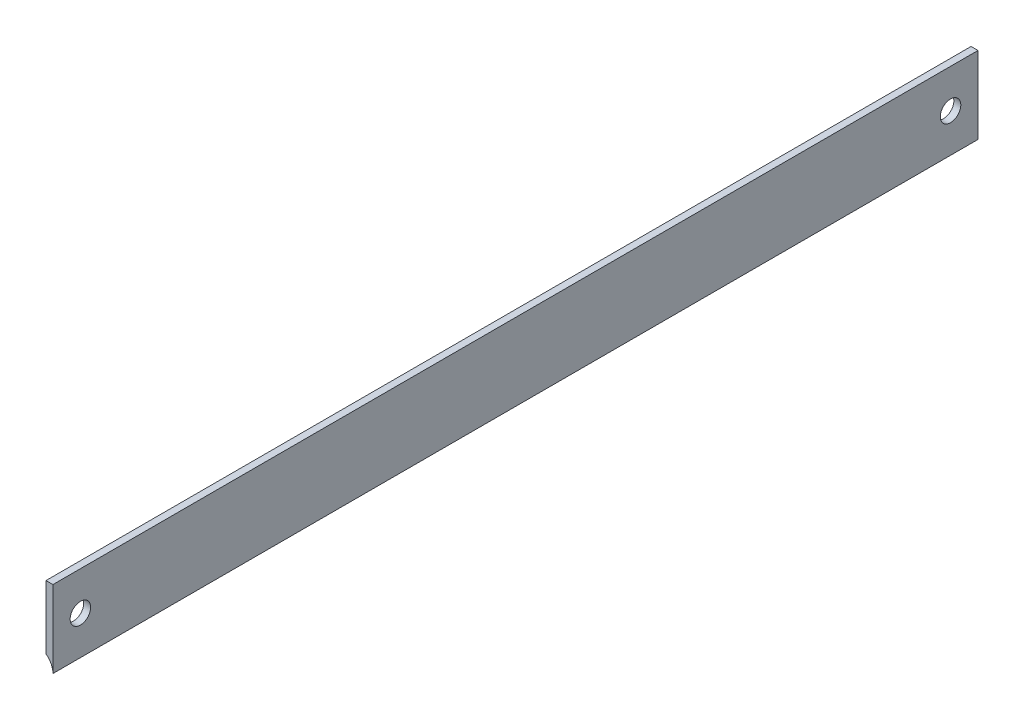
ISO-10303-21;
HEADER;
FILE_DESCRIPTION(('STEP AP214'),'2;1');
FILE_NAME('part.step','',(''),(''),'','','');
FILE_SCHEMA(('AUTOMOTIVE_DESIGN { 1 0 10303 214 1 1 1 1 }'));
ENDSEC;
DATA;
#1=APPLICATION_CONTEXT('core data for automotive mechanical design processes');
#2=APPLICATION_PROTOCOL_DEFINITION('international standard','automotive_design',2000,#1);
#3=PRODUCT_CONTEXT('',#1,'mechanical');
#4=PRODUCT('Part','Part','',(#3));
#5=PRODUCT_RELATED_PRODUCT_CATEGORY('part','',(#4));
#6=PRODUCT_DEFINITION_FORMATION('','',#4);
#7=PRODUCT_DEFINITION_CONTEXT('part definition',#1,'design');
#8=PRODUCT_DEFINITION('design','',#6,#7);
#9=PRODUCT_DEFINITION_SHAPE('','',#8);
#10=(LENGTH_UNIT() NAMED_UNIT(*) SI_UNIT(.MILLI.,.METRE.));
#11=(NAMED_UNIT(*) PLANE_ANGLE_UNIT() SI_UNIT($,.RADIAN.));
#12=(NAMED_UNIT(*) SI_UNIT($,.STERADIAN.) SOLID_ANGLE_UNIT());
#13=UNCERTAINTY_MEASURE_WITH_UNIT(LENGTH_MEASURE(1.E-05),#10,'distance_accuracy_value','');
#14=(GEOMETRIC_REPRESENTATION_CONTEXT(3) GLOBAL_UNCERTAINTY_ASSIGNED_CONTEXT((#13)) GLOBAL_UNIT_ASSIGNED_CONTEXT((#10,
#11,#12)) REPRESENTATION_CONTEXT('',''));
#15=CARTESIAN_POINT('',(0.,0.,0.));
#16=DIRECTION('',(0.,0.,1.));
#17=DIRECTION('',(1.,0.,0.));
#18=AXIS2_PLACEMENT_3D('',#15,#16,#17);
#19=CARTESIAN_POINT('',(1.143,-12.7,304.8));
#20=DIRECTION('',(-1.,0.,0.));
#21=DIRECTION('',(0.,0.,1.));
#22=AXIS2_PLACEMENT_3D('',#19,#20,#21);
#23=PLANE('',#22);
#24=CARTESIAN_POINT('',(1.143,0.,9.050000188));
#25=DIRECTION('',(-1.,0.,0.));
#26=DIRECTION('',(0.,0.,1.));
#27=AXIS2_PLACEMENT_3D('',#24,#25,#26);
#28=CIRCLE('',#27,3.37819999999999);
#29=CARTESIAN_POINT('',(1.143,0.,12.428200188));
#30=VERTEX_POINT('',#29);
#31=EDGE_CURVE('E114',#30,#30,#28,.T.);
#32=ORIENTED_EDGE('',*,*,#31,.T.);
#33=EDGE_LOOP('',(#32));
#34=FACE_BOUND('',#33,.T.);
#35=CARTESIAN_POINT('',(1.143,0.,295.749999812));
#36=DIRECTION('',(-1.,0.,0.));
#37=DIRECTION('',(0.,0.,1.));
#38=AXIS2_PLACEMENT_3D('',#35,#36,#37);
#39=CIRCLE('',#38,3.37819999999999);
#40=CARTESIAN_POINT('',(1.143,0.,299.128199812));
#41=VERTEX_POINT('',#40);
#42=EDGE_CURVE('E98',#41,#41,#39,.T.);
#43=ORIENTED_EDGE('',*,*,#42,.T.);
#44=EDGE_LOOP('',(#43));
#45=FACE_BOUND('',#44,.T.);
#46=DIRECTION('',(0.,1.,0.));
#47=VECTOR('',#46,1.);
#48=CARTESIAN_POINT('',(1.143,-12.7,0.));
#49=LINE('',#48,#47);
#50=CARTESIAN_POINT('',(1.143,-12.7,0.));
#51=VERTEX_POINT('',#50);
#52=CARTESIAN_POINT('',(1.143,12.7,0.));
#53=VERTEX_POINT('',#52);
#54=EDGE_CURVE('E95',#51,#53,#49,.T.);
#55=ORIENTED_EDGE('',*,*,#54,.T.);
#56=DIRECTION('',(0.,0.,-1.));
#57=VECTOR('',#56,1.);
#58=CARTESIAN_POINT('',(1.143,12.7,304.8));
#59=LINE('',#58,#57);
#60=CARTESIAN_POINT('',(1.143,12.7,304.8));
#61=VERTEX_POINT('',#60);
#62=EDGE_CURVE('E11',#61,#53,#59,.T.);
#63=ORIENTED_EDGE('',*,*,#62,.F.);
#64=DIRECTION('',(0.,1.,0.));
#65=VECTOR('',#64,1.);
#66=CARTESIAN_POINT('',(1.143,-12.7,304.8));
#67=LINE('',#66,#65);
#68=CARTESIAN_POINT('',(1.143,-12.7,304.8));
#69=VERTEX_POINT('',#68);
#70=EDGE_CURVE('E83',#69,#61,#67,.T.);
#71=ORIENTED_EDGE('',*,*,#70,.F.);
#72=DIRECTION('',(0.,0.,-1.));
#73=VECTOR('',#72,1.);
#74=CARTESIAN_POINT('',(1.143,-12.7,304.8));
#75=LINE('',#74,#73);
#76=EDGE_CURVE('E91',#69,#51,#75,.T.);
#77=ORIENTED_EDGE('',*,*,#76,.T.);
#78=EDGE_LOOP('',(#55,#63,#71,#77));
#79=FACE_BOUND('',#78,.T.);
#80=ADVANCED_FACE('F32',(#34,#45,#79),#23,.F.);
#81=CARTESIAN_POINT('',(-1.143,12.7,304.8));
#82=DIRECTION('',(0.,-1.,0.));
#83=DIRECTION('',(0.,0.,-1.));
#84=AXIS2_PLACEMENT_3D('',#81,#82,#83);
#85=PLANE('',#84);
#86=DIRECTION('',(-1.,0.,0.));
#87=VECTOR('',#86,1.);
#88=CARTESIAN_POINT('',(-1.143,12.7,0.));
#89=LINE('',#88,#87);
#90=CARTESIAN_POINT('',(-1.143,12.7,0.));
#91=VERTEX_POINT('',#90);
#92=EDGE_CURVE('E87',#53,#91,#89,.T.);
#93=ORIENTED_EDGE('',*,*,#92,.T.);
#94=DIRECTION('',(0.,0.,-1.));
#95=VECTOR('',#94,1.);
#96=CARTESIAN_POINT('',(-1.143,12.7,304.8));
#97=LINE('',#96,#95);
#98=CARTESIAN_POINT('',(-1.143,12.7,304.8));
#99=VERTEX_POINT('',#98);
#100=EDGE_CURVE('E40',#99,#91,#97,.T.);
#101=ORIENTED_EDGE('',*,*,#100,.F.);
#102=DIRECTION('',(-1.,0.,0.));
#103=VECTOR('',#102,1.);
#104=CARTESIAN_POINT('',(-1.143,12.7,304.8));
#105=LINE('',#104,#103);
#106=EDGE_CURVE('E78',#61,#99,#105,.T.);
#107=ORIENTED_EDGE('',*,*,#106,.F.);
#108=ORIENTED_EDGE('',*,*,#62,.T.);
#109=EDGE_LOOP('',(#93,#101,#107,#108));
#110=FACE_BOUND('',#109,.T.);
#111=ADVANCED_FACE('F86',(#110),#85,.F.);
#112=CARTESIAN_POINT('',(-1.143,-8.25681465612788,304.8));
#113=DIRECTION('',(1.,0.,0.));
#114=DIRECTION('',(0.,1.,0.));
#115=AXIS2_PLACEMENT_3D('',#112,#113,#114);
#116=PLANE('',#115);
#117=CARTESIAN_POINT('',(-1.143,0.,9.050000188));
#118=DIRECTION('',(-1.,0.,0.));
#119=DIRECTION('',(0.,0.,1.));
#120=AXIS2_PLACEMENT_3D('',#117,#118,#119);
#121=CIRCLE('',#120,3.37819999999999);
#122=CARTESIAN_POINT('',(-1.143,0.,12.428200188));
#123=VERTEX_POINT('',#122);
#124=EDGE_CURVE('E117',#123,#123,#121,.T.);
#125=ORIENTED_EDGE('',*,*,#124,.F.);
#126=EDGE_LOOP('',(#125));
#127=FACE_BOUND('',#126,.T.);
#128=CARTESIAN_POINT('',(-1.143,0.,295.749999812));
#129=DIRECTION('',(-1.,0.,0.));
#130=DIRECTION('',(0.,0.,1.));
#131=AXIS2_PLACEMENT_3D('',#128,#129,#130);
#132=CIRCLE('',#131,3.37819999999999);
#133=CARTESIAN_POINT('',(-1.143,0.,299.128199812));
#134=VERTEX_POINT('',#133);
#135=EDGE_CURVE('E111',#134,#134,#132,.T.);
#136=ORIENTED_EDGE('',*,*,#135,.F.);
#137=EDGE_LOOP('',(#136));
#138=FACE_BOUND('',#137,.T.);
#139=DIRECTION('',(0.,-1.,0.));
#140=VECTOR('',#139,1.);
#141=CARTESIAN_POINT('',(-1.143,-8.25681465612788,0.));
#142=LINE('',#141,#140);
#143=CARTESIAN_POINT('',(-1.143,-8.25681465612788,0.));
#144=VERTEX_POINT('',#143);
#145=EDGE_CURVE('E65',#91,#144,#142,.T.);
#146=ORIENTED_EDGE('',*,*,#145,.T.);
#147=DIRECTION('',(0.,0.,-1.));
#148=VECTOR('',#147,1.);
#149=CARTESIAN_POINT('',(-1.143,-8.25681465612788,304.8));
#150=LINE('',#149,#148);
#151=CARTESIAN_POINT('',(-1.143,-8.25681465612788,304.8));
#152=VERTEX_POINT('',#151);
#153=EDGE_CURVE('E88',#152,#144,#150,.T.);
#154=ORIENTED_EDGE('',*,*,#153,.F.);
#155=DIRECTION('',(0.,-1.,0.));
#156=VECTOR('',#155,1.);
#157=CARTESIAN_POINT('',(-1.143,-8.25681465612788,304.8));
#158=LINE('',#157,#156);
#159=EDGE_CURVE('E81',#99,#152,#158,.T.);
#160=ORIENTED_EDGE('',*,*,#159,.F.);
#161=ORIENTED_EDGE('',*,*,#100,.T.);
#162=EDGE_LOOP('',(#146,#154,#160,#161));
#163=FACE_BOUND('',#162,.T.);
#164=ADVANCED_FACE('F89',(#127,#138,#163),#116,.F.);
#165=CARTESIAN_POINT('',(-4.318,-12.7,304.8));
#166=DIRECTION('',(0.,0.,-1.));
#167=DIRECTION('',(-1.,0.,0.));
#168=AXIS2_PLACEMENT_3D('',#165,#166,#167);
#169=CYLINDRICAL_SURFACE('',#168,5.461);
#170=CARTESIAN_POINT('',(-4.318,-12.7,0.));
#171=DIRECTION('',(0.,0.,-1.));
#172=DIRECTION('',(1.,0.,0.));
#173=AXIS2_PLACEMENT_3D('',#170,#171,#172);
#174=CIRCLE('',#173,5.461);
#175=EDGE_CURVE('E71',#144,#51,#174,.T.);
#176=ORIENTED_EDGE('',*,*,#175,.T.);
#177=ORIENTED_EDGE('',*,*,#76,.F.);
#178=CARTESIAN_POINT('',(-4.318,-12.7,304.8));
#179=DIRECTION('',(0.,0.,-1.));
#180=DIRECTION('',(1.,0.,0.));
#181=AXIS2_PLACEMENT_3D('',#178,#179,#180);
#182=CIRCLE('',#181,5.461);
#183=EDGE_CURVE('E48',#152,#69,#182,.T.);
#184=ORIENTED_EDGE('',*,*,#183,.F.);
#185=ORIENTED_EDGE('',*,*,#153,.T.);
#186=EDGE_LOOP('',(#176,#177,#184,#185));
#187=FACE_BOUND('',#186,.T.);
#188=ADVANCED_FACE('F103',(#187),#169,.F.);
#189=CARTESIAN_POINT('',(-4.318,-12.7,304.8));
#190=DIRECTION('',(0.,0.,1.));
#191=DIRECTION('',(1.,0.,0.));
#192=AXIS2_PLACEMENT_3D('',#189,#190,#191);
#193=PLANE('',#192);
#194=ORIENTED_EDGE('',*,*,#70,.T.);
#195=ORIENTED_EDGE('',*,*,#106,.T.);
#196=ORIENTED_EDGE('',*,*,#159,.T.);
#197=ORIENTED_EDGE('',*,*,#183,.T.);
#198=EDGE_LOOP('',(#194,#195,#196,#197));
#199=FACE_BOUND('',#198,.T.);
#200=ADVANCED_FACE('F79',(#199),#193,.T.);
#201=CARTESIAN_POINT('',(-4.318,-12.7,0.));
#202=DIRECTION('',(0.,0.,1.));
#203=DIRECTION('',(1.,0.,0.));
#204=AXIS2_PLACEMENT_3D('',#201,#202,#203);
#205=PLANE('',#204);
#206=ORIENTED_EDGE('',*,*,#54,.F.);
#207=ORIENTED_EDGE('',*,*,#175,.F.);
#208=ORIENTED_EDGE('',*,*,#145,.F.);
#209=ORIENTED_EDGE('',*,*,#92,.F.);
#210=EDGE_LOOP('',(#206,#207,#208,#209));
#211=FACE_BOUND('',#210,.T.);
#212=ADVANCED_FACE('F106',(#211),#205,.F.);
#213=CARTESIAN_POINT('',(-1.143,0.,295.749999812));
#214=DIRECTION('',(-1.,0.,0.));
#215=DIRECTION('',(0.,0.,1.));
#216=AXIS2_PLACEMENT_3D('',#213,#214,#215);
#217=CYLINDRICAL_SURFACE('',#216,3.37819999999999);
#218=ORIENTED_EDGE('',*,*,#42,.F.);
#219=EDGE_LOOP('',(#218));
#220=FACE_BOUND('',#219,.T.);
#221=ORIENTED_EDGE('',*,*,#135,.T.);
#222=EDGE_LOOP('',(#221));
#223=FACE_BOUND('',#222,.T.);
#224=ADVANCED_FACE('F128',(#220,#223),#217,.F.);
#225=CARTESIAN_POINT('',(-1.143,0.,9.050000188));
#226=DIRECTION('',(-1.,0.,0.));
#227=DIRECTION('',(0.,0.,1.));
#228=AXIS2_PLACEMENT_3D('',#225,#226,#227);
#229=CYLINDRICAL_SURFACE('',#228,3.37819999999999);
#230=ORIENTED_EDGE('',*,*,#31,.F.);
#231=EDGE_LOOP('',(#230));
#232=FACE_BOUND('',#231,.T.);
#233=ORIENTED_EDGE('',*,*,#124,.T.);
#234=EDGE_LOOP('',(#233));
#235=FACE_BOUND('',#234,.T.);
#236=ADVANCED_FACE('F121',(#232,#235),#229,.F.);
#237=CLOSED_SHELL('',(#80,#111,#164,#188,#200,#212,#224,#236));
#238=MANIFOLD_SOLID_BREP('B2',#237);
#239=ADVANCED_BREP_SHAPE_REPRESENTATION('',(#18,#238),#14);
#240=SHAPE_DEFINITION_REPRESENTATION(#9,#239);
ENDSEC;
END-ISO-10303-21;
